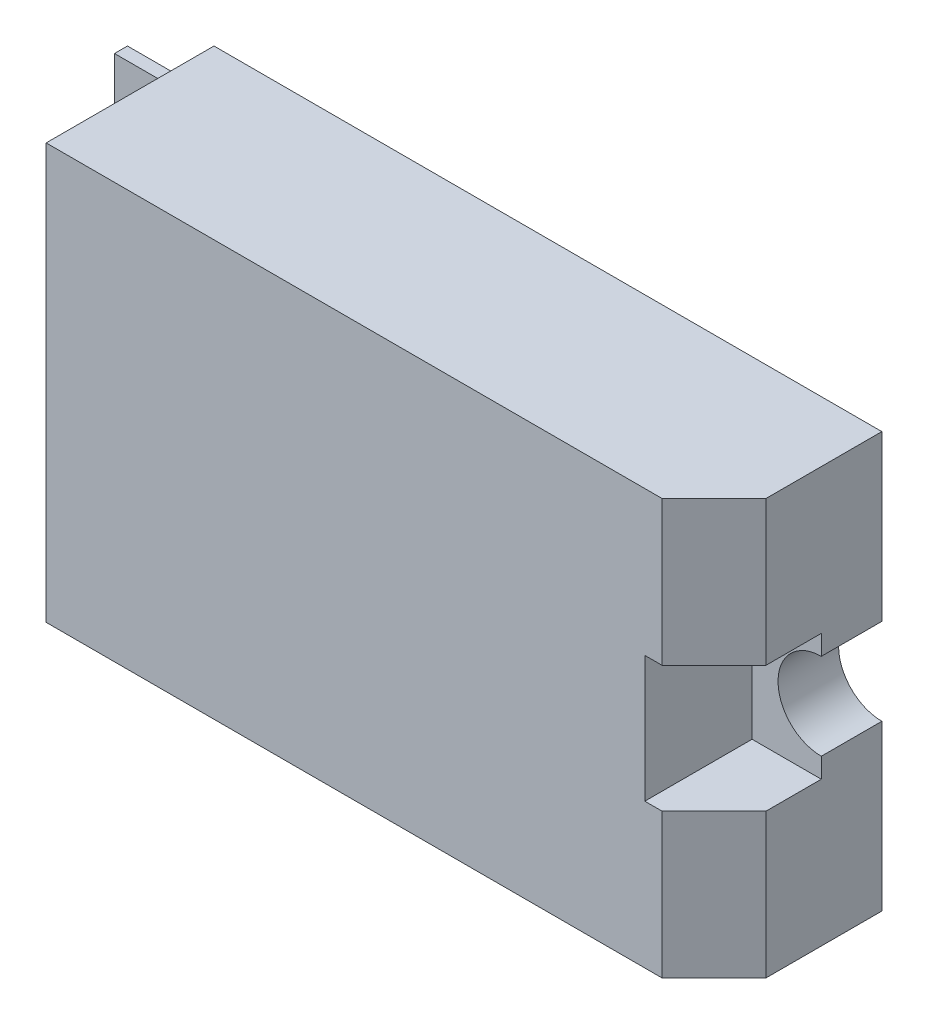
ISO-10303-21;
HEADER;
FILE_DESCRIPTION(('STEP AP214'),'2;1');
FILE_NAME('part.step','',(''),(''),'','','');
FILE_SCHEMA(('AUTOMOTIVE_DESIGN { 1 0 10303 214 1 1 1 1 }'));
ENDSEC;
DATA;
#1=APPLICATION_CONTEXT('core data for automotive mechanical design processes');
#2=APPLICATION_PROTOCOL_DEFINITION('international standard','automotive_design',2000,#1);
#3=PRODUCT_CONTEXT('',#1,'mechanical');
#4=PRODUCT('Part','Part','',(#3));
#5=PRODUCT_RELATED_PRODUCT_CATEGORY('part','',(#4));
#6=PRODUCT_DEFINITION_FORMATION('','',#4);
#7=PRODUCT_DEFINITION_CONTEXT('part definition',#1,'design');
#8=PRODUCT_DEFINITION('design','',#6,#7);
#9=PRODUCT_DEFINITION_SHAPE('','',#8);
#10=(LENGTH_UNIT() NAMED_UNIT(*) SI_UNIT(.MILLI.,.METRE.));
#11=(NAMED_UNIT(*) PLANE_ANGLE_UNIT() SI_UNIT($,.RADIAN.));
#12=(NAMED_UNIT(*) SI_UNIT($,.STERADIAN.) SOLID_ANGLE_UNIT());
#13=UNCERTAINTY_MEASURE_WITH_UNIT(LENGTH_MEASURE(1.E-05),#10,'distance_accuracy_value','');
#14=(GEOMETRIC_REPRESENTATION_CONTEXT(3) GLOBAL_UNCERTAINTY_ASSIGNED_CONTEXT((#13)) GLOBAL_UNIT_ASSIGNED_CONTEXT((#10,
#11,#12)) REPRESENTATION_CONTEXT('',''));
#15=CARTESIAN_POINT('',(0.,0.,0.));
#16=DIRECTION('',(0.,0.,1.));
#17=DIRECTION('',(1.,0.,0.));
#18=AXIS2_PLACEMENT_3D('',#15,#16,#17);
#19=CARTESIAN_POINT('',(1.50135924250436,-45.8595427549521,-34.4125020386911));
#20=DIRECTION('',(-1.,0.,0.));
#21=DIRECTION('',(0.,-1.,0.));
#22=AXIS2_PLACEMENT_3D('',#19,#20,#21);
#23=PLANE('',#22);
#24=DIRECTION('',(0.,1.,0.));
#25=VECTOR('',#24,1.);
#26=CARTESIAN_POINT('',(1.50135924250436,-45.8595427549521,-44.1125020386911));
#27=LINE('',#26,#25);
#28=CARTESIAN_POINT('',(1.50135924250436,-69.8595427549521,-44.1125020386911));
#29=VERTEX_POINT('',#28);
#30=CARTESIAN_POINT('',(1.50135924250436,-60.3595427549521,-44.1125020386911));
#31=VERTEX_POINT('',#30);
#32=EDGE_CURVE('E176',#29,#31,#27,.T.);
#33=ORIENTED_EDGE('',*,*,#32,.T.);
#34=DIRECTION('',(0.,0.,1.));
#35=VECTOR('',#34,1.);
#36=CARTESIAN_POINT('',(1.50135924250436,-60.3595427549521,-44.1125020386911));
#37=LINE('',#36,#35);
#38=CARTESIAN_POINT('',(1.50135924250436,-60.3595427549521,-40.6125020386911));
#39=VERTEX_POINT('',#38);
#40=EDGE_CURVE('E157',#31,#39,#37,.T.);
#41=ORIENTED_EDGE('',*,*,#40,.T.);
#42=DIRECTION('',(0.,1.,0.));
#43=VECTOR('',#42,1.);
#44=CARTESIAN_POINT('',(1.50135924250436,-54.2095427549521,-40.6125020386911));
#45=LINE('',#44,#43);
#46=CARTESIAN_POINT('',(1.50135924250436,-61.5095427549521,-40.6125020386911));
#47=VERTEX_POINT('',#46);
#48=EDGE_CURVE('E263',#47,#39,#45,.T.);
#49=ORIENTED_EDGE('',*,*,#48,.F.);
#50=DIRECTION('',(0.,0.,1.));
#51=VECTOR('',#50,1.);
#52=CARTESIAN_POINT('',(1.50135924250436,-61.5095427549521,-40.6125020386911));
#53=LINE('',#52,#51);
#54=CARTESIAN_POINT('',(1.50135924250435,-61.5095427549521,-37.4125020386911));
#55=VERTEX_POINT('',#54);
#56=EDGE_CURVE('E267',#47,#55,#53,.T.);
#57=ORIENTED_EDGE('',*,*,#56,.T.);
#58=DIRECTION('',(0.,-1.,0.));
#59=VECTOR('',#58,1.);
#60=CARTESIAN_POINT('',(1.50135924250436,-69.8595427549521,-37.4125020386911));
#61=LINE('',#60,#59);
#62=CARTESIAN_POINT('',(1.50135924250436,-69.8595427549521,-37.4125020386911));
#63=VERTEX_POINT('',#62);
#64=EDGE_CURVE('E203',#55,#63,#61,.T.);
#65=ORIENTED_EDGE('',*,*,#64,.T.);
#66=DIRECTION('',(0.,0.,-1.));
#67=VECTOR('',#66,1.);
#68=CARTESIAN_POINT('',(1.50135924250436,-69.8595427549521,-34.4125020386911));
#69=LINE('',#68,#67);
#70=EDGE_CURVE('E192',#63,#29,#69,.T.);
#71=ORIENTED_EDGE('',*,*,#70,.T.);
#72=EDGE_LOOP('',(#33,#41,#49,#57,#65,#71));
#73=FACE_BOUND('',#72,.T.);
#74=ADVANCED_FACE('F42',(#73),#23,.F.);
#75=CARTESIAN_POINT('',(-1.49864075749565,0.,-34.4125020386911));
#76=DIRECTION('',(0.707106781186549,0.,0.707106781186546));
#77=DIRECTION('',(0.,-1.,0.));
#78=AXIS2_PLACEMENT_3D('',#75,#76,#77);
#79=PLANE('',#78);
#80=DIRECTION('',(0.707106781186546,0.,-0.707106781186549));
#81=VECTOR('',#80,1.);
#82=CARTESIAN_POINT('',(-1.49864075749559,-61.5095427549521,-34.4125020386911));
#83=LINE('',#82,#81);
#84=CARTESIAN_POINT('',(-1.49864075749563,-61.5095427549521,-34.4125020386911));
#85=VERTEX_POINT('',#84);
#86=EDGE_CURVE('E11',#85,#55,#83,.T.);
#87=ORIENTED_EDGE('',*,*,#86,.F.);
#88=DIRECTION('',(0.,1.,0.));
#89=VECTOR('',#88,1.);
#90=CARTESIAN_POINT('',(-1.49864075749564,-45.8595427549521,-34.4125020386911));
#91=LINE('',#90,#89);
#92=CARTESIAN_POINT('',(-1.49864075749563,-69.8595427549521,-34.4125020386911));
#93=VERTEX_POINT('',#92);
#94=EDGE_CURVE('E198',#93,#85,#91,.T.);
#95=ORIENTED_EDGE('',*,*,#94,.F.);
#96=DIRECTION('',(-0.707106781186546,0.,0.707106781186549));
#97=VECTOR('',#96,1.);
#98=CARTESIAN_POINT('',(-1.49864075749564,-69.8595427549521,-34.412502038691));
#99=LINE('',#98,#97);
#100=EDGE_CURVE('E207',#63,#93,#99,.T.);
#101=ORIENTED_EDGE('',*,*,#100,.F.);
#102=ORIENTED_EDGE('',*,*,#64,.F.);
#103=EDGE_LOOP('',(#87,#95,#101,#102));
#104=FACE_BOUND('',#103,.T.);
#105=ADVANCED_FACE('F259',(#104),#79,.T.);
#106=CARTESIAN_POINT('',(-37.0986407574956,-45.8595427549521,-34.4125020386911));
#107=DIRECTION('',(1.,0.,0.));
#108=DIRECTION('',(0.,0.,-1.));
#109=AXIS2_PLACEMENT_3D('',#106,#107,#108);
#110=PLANE('',#109);
#111=DIRECTION('',(0.,-1.,0.));
#112=VECTOR('',#111,1.);
#113=CARTESIAN_POINT('',(-37.0986407574956,-45.8595427549521,-44.1125020386911));
#114=LINE('',#113,#112);
#115=CARTESIAN_POINT('',(-37.0986407574956,-45.8595427549521,-44.1125020386911));
#116=VERTEX_POINT('',#115);
#117=CARTESIAN_POINT('',(-37.0986407574956,-69.8595427549521,-44.1125020386911));
#118=VERTEX_POINT('',#117);
#119=EDGE_CURVE('E180',#116,#118,#114,.T.);
#120=ORIENTED_EDGE('',*,*,#119,.T.);
#121=DIRECTION('',(0.,0.,-1.));
#122=VECTOR('',#121,1.);
#123=CARTESIAN_POINT('',(-37.0986407574956,-69.8595427549521,-34.4125020386911));
#124=LINE('',#123,#122);
#125=CARTESIAN_POINT('',(-37.0986407574956,-69.8595427549521,-34.4125020386911));
#126=VERTEX_POINT('',#125);
#127=EDGE_CURVE('E194',#126,#118,#124,.T.);
#128=ORIENTED_EDGE('',*,*,#127,.F.);
#129=DIRECTION('',(0.,-1.,0.));
#130=VECTOR('',#129,1.);
#131=CARTESIAN_POINT('',(-37.0986407574956,-45.8595427549521,-34.4125020386911));
#132=LINE('',#131,#130);
#133=CARTESIAN_POINT('',(-37.0986407574956,-45.8595427549521,-34.4125020386911));
#134=VERTEX_POINT('',#133);
#135=EDGE_CURVE('E185',#134,#126,#132,.T.);
#136=ORIENTED_EDGE('',*,*,#135,.F.);
#137=DIRECTION('',(0.,0.,-1.));
#138=VECTOR('',#137,1.);
#139=CARTESIAN_POINT('',(-37.0986407574956,-45.8595427549521,-34.4125020386911));
#140=LINE('',#139,#138);
#141=EDGE_CURVE('E186',#134,#116,#140,.T.);
#142=ORIENTED_EDGE('',*,*,#141,.T.);
#143=EDGE_LOOP('',(#120,#128,#136,#142));
#144=FACE_BOUND('',#143,.T.);
#145=DIRECTION('',(0.,-1.,0.));
#146=VECTOR('',#145,1.);
#147=CARTESIAN_POINT('',(-37.0986407574956,-47.3595427549521,-43.1125020386911));
#148=LINE('',#147,#146);
#149=CARTESIAN_POINT('',(-37.0986407574956,-47.3595427549521,-43.1125020386911));
#150=VERTEX_POINT('',#149);
#151=CARTESIAN_POINT('',(-37.0986407574956,-68.3595427549521,-43.112502038691));
#152=VERTEX_POINT('',#151);
#153=EDGE_CURVE('E270',#150,#152,#148,.T.);
#154=ORIENTED_EDGE('',*,*,#153,.F.);
#155=DIRECTION('',(0.,0.,-1.));
#156=VECTOR('',#155,1.);
#157=CARTESIAN_POINT('',(-37.0986407574956,-47.3595427549521,-43.1125020386911));
#158=LINE('',#157,#156);
#159=CARTESIAN_POINT('',(-37.0986407574956,-47.3595427549521,-42.362502038691));
#160=VERTEX_POINT('',#159);
#161=EDGE_CURVE('E281',#160,#150,#158,.T.);
#162=ORIENTED_EDGE('',*,*,#161,.F.);
#163=DIRECTION('',(0.,1.,0.));
#164=VECTOR('',#163,1.);
#165=CARTESIAN_POINT('',(-37.0986407574956,-47.3595427549521,-42.362502038691));
#166=LINE('',#165,#164);
#167=CARTESIAN_POINT('',(-37.0986407574956,-68.3595427549521,-42.362502038691));
#168=VERTEX_POINT('',#167);
#169=EDGE_CURVE('E291',#168,#160,#166,.T.);
#170=ORIENTED_EDGE('',*,*,#169,.F.);
#171=DIRECTION('',(0.,0.,1.));
#172=VECTOR('',#171,1.);
#173=CARTESIAN_POINT('',(-37.0986407574956,-68.3595427549521,-43.112502038691));
#174=LINE('',#173,#172);
#175=EDGE_CURVE('E289',#152,#168,#174,.T.);
#176=ORIENTED_EDGE('',*,*,#175,.F.);
#177=EDGE_LOOP('',(#154,#162,#170,#176));
#178=FACE_BOUND('',#177,.T.);
#179=ADVANCED_FACE('F250',(#144,#178),#110,.F.);
#180=CARTESIAN_POINT('',(-37.0986407574956,-69.8595427549521,-34.4125020386911));
#181=DIRECTION('',(0.,1.,0.));
#182=DIRECTION('',(0.,0.,1.));
#183=AXIS2_PLACEMENT_3D('',#180,#181,#182);
#184=PLANE('',#183);
#185=ORIENTED_EDGE('',*,*,#70,.F.);
#186=ORIENTED_EDGE('',*,*,#100,.T.);
#187=DIRECTION('',(1.,0.,0.));
#188=VECTOR('',#187,1.);
#189=CARTESIAN_POINT('',(-37.0986407574956,-69.8595427549521,-34.4125020386911));
#190=LINE('',#189,#188);
#191=EDGE_CURVE('E229',#126,#93,#190,.T.);
#192=ORIENTED_EDGE('',*,*,#191,.F.);
#193=ORIENTED_EDGE('',*,*,#127,.T.);
#194=DIRECTION('',(1.,0.,0.));
#195=VECTOR('',#194,1.);
#196=CARTESIAN_POINT('',(-37.0986407574956,-69.8595427549521,-44.1125020386911));
#197=LINE('',#196,#195);
#198=EDGE_CURVE('E177',#118,#29,#197,.T.);
#199=ORIENTED_EDGE('',*,*,#198,.T.);
#200=EDGE_LOOP('',(#185,#186,#192,#193,#199));
#201=FACE_BOUND('',#200,.T.);
#202=ADVANCED_FACE('F254',(#201),#184,.F.);
#203=CARTESIAN_POINT('',(1.50135924250436,-55.3595427549521,-40.6125020386911));
#204=VERTEX_POINT('',#203);
#205=CARTESIAN_POINT('',(1.50135924250436,-54.2095427549521,-40.6125020386911));
#206=VERTEX_POINT('',#205);
#207=EDGE_CURVE('E170',#204,#206,#45,.T.);
#208=ORIENTED_EDGE('',*,*,#207,.F.);
#209=DIRECTION('',(0.,0.,1.));
#210=VECTOR('',#209,1.);
#211=CARTESIAN_POINT('',(1.50135924250436,-55.3595427549521,-44.1125020386911));
#212=LINE('',#211,#210);
#213=CARTESIAN_POINT('',(1.50135924250436,-55.3595427549521,-44.1125020386911));
#214=VERTEX_POINT('',#213);
#215=EDGE_CURVE('E58',#204,#214,#212,.F.);
#216=ORIENTED_EDGE('',*,*,#215,.T.);
#217=CARTESIAN_POINT('',(1.50135924250436,-45.8595427549521,-44.1125020386911));
#218=VERTEX_POINT('',#217);
#219=EDGE_CURVE('E168',#214,#218,#27,.T.);
#220=ORIENTED_EDGE('',*,*,#219,.T.);
#221=DIRECTION('',(0.,0.,-1.));
#222=VECTOR('',#221,1.);
#223=CARTESIAN_POINT('',(1.50135924250436,-45.8595427549521,-34.4125020386911));
#224=LINE('',#223,#222);
#225=CARTESIAN_POINT('',(1.50135924250436,-45.8595427549521,-37.4125020386911));
#226=VERTEX_POINT('',#225);
#227=EDGE_CURVE('E189',#226,#218,#224,.T.);
#228=ORIENTED_EDGE('',*,*,#227,.F.);
#229=CARTESIAN_POINT('',(1.50135924250436,-54.2095427549521,-37.4125020386911));
#230=VERTEX_POINT('',#229);
#231=EDGE_CURVE('E204',#226,#230,#61,.T.);
#232=ORIENTED_EDGE('',*,*,#231,.T.);
#233=DIRECTION('',(0.,0.,1.));
#234=VECTOR('',#233,1.);
#235=CARTESIAN_POINT('',(1.50135924250436,-54.2095427549521,-40.6125020386911));
#236=LINE('',#235,#234);
#237=EDGE_CURVE('E66',#206,#230,#236,.T.);
#238=ORIENTED_EDGE('',*,*,#237,.F.);
#239=EDGE_LOOP('',(#208,#216,#220,#228,#232,#238));
#240=FACE_BOUND('',#239,.T.);
#241=ADVANCED_FACE('F166',(#240),#23,.F.);
#242=CARTESIAN_POINT('',(-37.0986407574956,-45.8595427549521,-34.4125020386911));
#243=DIRECTION('',(0.,-1.,0.));
#244=DIRECTION('',(0.,0.,-1.));
#245=AXIS2_PLACEMENT_3D('',#242,#243,#244);
#246=PLANE('',#245);
#247=DIRECTION('',(-1.,0.,0.));
#248=VECTOR('',#247,1.);
#249=CARTESIAN_POINT('',(-37.0986407574956,-45.8595427549521,-34.4125020386911));
#250=LINE('',#249,#248);
#251=CARTESIAN_POINT('',(-1.49864075749564,-45.8595427549521,-34.4125020386911));
#252=VERTEX_POINT('',#251);
#253=EDGE_CURVE('E190',#252,#134,#250,.T.);
#254=ORIENTED_EDGE('',*,*,#253,.F.);
#255=DIRECTION('',(0.707106781186546,0.,-0.707106781186549));
#256=VECTOR('',#255,1.);
#257=CARTESIAN_POINT('',(-1.49864075749564,-45.8595427549521,-34.412502038691));
#258=LINE('',#257,#256);
#259=EDGE_CURVE('E201',#252,#226,#258,.T.);
#260=ORIENTED_EDGE('',*,*,#259,.T.);
#261=ORIENTED_EDGE('',*,*,#227,.T.);
#262=DIRECTION('',(-1.,0.,0.));
#263=VECTOR('',#262,1.);
#264=CARTESIAN_POINT('',(-37.0986407574956,-45.8595427549521,-44.1125020386911));
#265=LINE('',#264,#263);
#266=EDGE_CURVE('E175',#218,#116,#265,.T.);
#267=ORIENTED_EDGE('',*,*,#266,.T.);
#268=ORIENTED_EDGE('',*,*,#141,.F.);
#269=EDGE_LOOP('',(#254,#260,#261,#267,#268));
#270=FACE_BOUND('',#269,.T.);
#271=ADVANCED_FACE('F226',(#270),#246,.F.);
#272=CARTESIAN_POINT('',(0.,0.,-34.4125020386911));
#273=DIRECTION('',(0.,0.,1.));
#274=DIRECTION('',(1.,0.,0.));
#275=AXIS2_PLACEMENT_3D('',#272,#273,#274);
#276=PLANE('',#275);
#277=DIRECTION('',(1.,0.,0.));
#278=VECTOR('',#277,1.);
#279=CARTESIAN_POINT('',(1.50135924250436,-61.5095427549521,-34.4125020386911));
#280=LINE('',#279,#278);
#281=CARTESIAN_POINT('',(-2.49864075749564,-61.5095427549521,-34.4125020386911));
#282=VERTEX_POINT('',#281);
#283=EDGE_CURVE('E260',#282,#85,#280,.T.);
#284=ORIENTED_EDGE('',*,*,#283,.F.);
#285=DIRECTION('',(0.,-1.,0.));
#286=VECTOR('',#285,1.);
#287=CARTESIAN_POINT('',(-2.49864075749564,-54.2095427549521,-34.4125020386911));
#288=LINE('',#287,#286);
#289=CARTESIAN_POINT('',(-2.49864075749564,-54.2095427549521,-34.4125020386911));
#290=VERTEX_POINT('',#289);
#291=EDGE_CURVE('E221',#290,#282,#288,.T.);
#292=ORIENTED_EDGE('',*,*,#291,.F.);
#293=DIRECTION('',(-1.,0.,0.));
#294=VECTOR('',#293,1.);
#295=CARTESIAN_POINT('',(1.50135924250436,-54.2095427549521,-34.4125020386911));
#296=LINE('',#295,#294);
#297=CARTESIAN_POINT('',(-1.49864075749563,-54.2095427549521,-34.4125020386911));
#298=VERTEX_POINT('',#297);
#299=EDGE_CURVE('E210',#298,#290,#296,.T.);
#300=ORIENTED_EDGE('',*,*,#299,.F.);
#301=EDGE_CURVE('E197',#298,#252,#91,.T.);
#302=ORIENTED_EDGE('',*,*,#301,.T.);
#303=ORIENTED_EDGE('',*,*,#253,.T.);
#304=ORIENTED_EDGE('',*,*,#135,.T.);
#305=ORIENTED_EDGE('',*,*,#191,.T.);
#306=ORIENTED_EDGE('',*,*,#94,.T.);
#307=EDGE_LOOP('',(#284,#292,#300,#302,#303,#304,#305,#306));
#308=FACE_BOUND('',#307,.T.);
#309=ADVANCED_FACE('F218',(#308),#276,.T.);
#310=CARTESIAN_POINT('',(0.,0.,-44.1125020386911));
#311=DIRECTION('',(0.,0.,1.));
#312=DIRECTION('',(1.,0.,0.));
#313=AXIS2_PLACEMENT_3D('',#310,#311,#312);
#314=PLANE('',#313);
#315=ORIENTED_EDGE('',*,*,#219,.F.);
#316=CARTESIAN_POINT('',(1.50135924250436,-57.8595427549521,-44.1125020386911));
#317=DIRECTION('',(0.,0.,1.));
#318=DIRECTION('',(1.,0.,0.));
#319=AXIS2_PLACEMENT_3D('',#316,#317,#318);
#320=CIRCLE('',#319,2.5);
#321=EDGE_CURVE('E154',#214,#31,#320,.T.);
#322=ORIENTED_EDGE('',*,*,#321,.T.);
#323=ORIENTED_EDGE('',*,*,#32,.F.);
#324=ORIENTED_EDGE('',*,*,#198,.F.);
#325=ORIENTED_EDGE('',*,*,#119,.F.);
#326=ORIENTED_EDGE('',*,*,#266,.F.);
#327=EDGE_LOOP('',(#315,#322,#323,#324,#325,#326));
#328=FACE_BOUND('',#327,.T.);
#329=ADVANCED_FACE('F173',(#328),#314,.F.);
#330=CARTESIAN_POINT('',(-41.0986407574956,-47.3595427549521,-43.1125020386911));
#331=DIRECTION('',(0.,0.,1.));
#332=DIRECTION('',(0.,-1.,0.));
#333=AXIS2_PLACEMENT_3D('',#330,#331,#332);
#334=PLANE('',#333);
#335=ORIENTED_EDGE('',*,*,#153,.T.);
#336=DIRECTION('',(1.,0.,0.));
#337=VECTOR('',#336,1.);
#338=CARTESIAN_POINT('',(-41.0986407574956,-68.3595427549521,-43.112502038691));
#339=LINE('',#338,#337);
#340=CARTESIAN_POINT('',(-41.0986407574956,-68.3595427549521,-43.112502038691));
#341=VERTEX_POINT('',#340);
#342=EDGE_CURVE('E235',#341,#152,#339,.T.);
#343=ORIENTED_EDGE('',*,*,#342,.F.);
#344=DIRECTION('',(0.,-1.,0.));
#345=VECTOR('',#344,1.);
#346=CARTESIAN_POINT('',(-41.0986407574956,-47.3595427549521,-43.1125020386911));
#347=LINE('',#346,#345);
#348=CARTESIAN_POINT('',(-41.0986407574956,-47.3595427549521,-43.1125020386911));
#349=VERTEX_POINT('',#348);
#350=EDGE_CURVE('E277',#349,#341,#347,.T.);
#351=ORIENTED_EDGE('',*,*,#350,.F.);
#352=DIRECTION('',(1.,0.,0.));
#353=VECTOR('',#352,1.);
#354=CARTESIAN_POINT('',(-41.0986407574956,-47.3595427549521,-43.1125020386911));
#355=LINE('',#354,#353);
#356=EDGE_CURVE('E287',#349,#150,#355,.T.);
#357=ORIENTED_EDGE('',*,*,#356,.T.);
#358=EDGE_LOOP('',(#335,#343,#351,#357));
#359=FACE_BOUND('',#358,.T.);
#360=ADVANCED_FACE('F312',(#359),#334,.F.);
#361=CARTESIAN_POINT('',(-41.0986407574956,-68.3595427549521,-43.112502038691));
#362=DIRECTION('',(0.,1.,0.));
#363=DIRECTION('',(0.,0.,1.));
#364=AXIS2_PLACEMENT_3D('',#361,#362,#363);
#365=PLANE('',#364);
#366=ORIENTED_EDGE('',*,*,#175,.T.);
#367=DIRECTION('',(1.,0.,0.));
#368=VECTOR('',#367,1.);
#369=CARTESIAN_POINT('',(-41.0986407574956,-68.3595427549521,-42.362502038691));
#370=LINE('',#369,#368);
#371=CARTESIAN_POINT('',(-41.0986407574956,-68.3595427549521,-42.362502038691));
#372=VERTEX_POINT('',#371);
#373=EDGE_CURVE('E239',#372,#168,#370,.T.);
#374=ORIENTED_EDGE('',*,*,#373,.F.);
#375=DIRECTION('',(0.,0.,1.));
#376=VECTOR('',#375,1.);
#377=CARTESIAN_POINT('',(-41.0986407574956,-68.3595427549521,-43.112502038691));
#378=LINE('',#377,#376);
#379=EDGE_CURVE('E280',#341,#372,#378,.T.);
#380=ORIENTED_EDGE('',*,*,#379,.F.);
#381=ORIENTED_EDGE('',*,*,#342,.T.);
#382=EDGE_LOOP('',(#366,#374,#380,#381));
#383=FACE_BOUND('',#382,.T.);
#384=ADVANCED_FACE('F307',(#383),#365,.F.);
#385=CARTESIAN_POINT('',(-41.0986407574956,-47.3595427549521,-42.362502038691));
#386=DIRECTION('',(0.,0.,-1.));
#387=DIRECTION('',(-1.,0.,0.));
#388=AXIS2_PLACEMENT_3D('',#385,#386,#387);
#389=PLANE('',#388);
#390=ORIENTED_EDGE('',*,*,#169,.T.);
#391=DIRECTION('',(1.,0.,0.));
#392=VECTOR('',#391,1.);
#393=CARTESIAN_POINT('',(-41.0986407574956,-47.3595427549521,-42.362502038691));
#394=LINE('',#393,#392);
#395=CARTESIAN_POINT('',(-41.0986407574956,-47.3595427549521,-42.362502038691));
#396=VERTEX_POINT('',#395);
#397=EDGE_CURVE('E246',#396,#160,#394,.T.);
#398=ORIENTED_EDGE('',*,*,#397,.F.);
#399=DIRECTION('',(0.,1.,0.));
#400=VECTOR('',#399,1.);
#401=CARTESIAN_POINT('',(-41.0986407574956,-47.3595427549521,-42.362502038691));
#402=LINE('',#401,#400);
#403=EDGE_CURVE('E283',#372,#396,#402,.T.);
#404=ORIENTED_EDGE('',*,*,#403,.F.);
#405=ORIENTED_EDGE('',*,*,#373,.T.);
#406=EDGE_LOOP('',(#390,#398,#404,#405));
#407=FACE_BOUND('',#406,.T.);
#408=ADVANCED_FACE('F305',(#407),#389,.F.);
#409=CARTESIAN_POINT('',(-41.0986407574956,-47.3595427549521,-43.1125020386911));
#410=DIRECTION('',(0.,-1.,0.));
#411=DIRECTION('',(0.,0.,-1.));
#412=AXIS2_PLACEMENT_3D('',#409,#410,#411);
#413=PLANE('',#412);
#414=ORIENTED_EDGE('',*,*,#161,.T.);
#415=ORIENTED_EDGE('',*,*,#356,.F.);
#416=DIRECTION('',(0.,0.,-1.));
#417=VECTOR('',#416,1.);
#418=CARTESIAN_POINT('',(-41.0986407574956,-47.3595427549521,-43.1125020386911));
#419=LINE('',#418,#417);
#420=EDGE_CURVE('E285',#396,#349,#419,.T.);
#421=ORIENTED_EDGE('',*,*,#420,.F.);
#422=ORIENTED_EDGE('',*,*,#397,.T.);
#423=EDGE_LOOP('',(#414,#415,#421,#422));
#424=FACE_BOUND('',#423,.T.);
#425=ADVANCED_FACE('F301',(#424),#413,.F.);
#426=CARTESIAN_POINT('',(-41.0986407574956,0.,0.));
#427=DIRECTION('',(-1.,0.,0.));
#428=DIRECTION('',(0.,0.,1.));
#429=AXIS2_PLACEMENT_3D('',#426,#427,#428);
#430=PLANE('',#429);
#431=ORIENTED_EDGE('',*,*,#350,.T.);
#432=ORIENTED_EDGE('',*,*,#379,.T.);
#433=ORIENTED_EDGE('',*,*,#403,.T.);
#434=ORIENTED_EDGE('',*,*,#420,.T.);
#435=EDGE_LOOP('',(#431,#432,#433,#434));
#436=FACE_BOUND('',#435,.T.);
#437=ADVANCED_FACE('F310',(#436),#430,.T.);
#438=DIRECTION('',(-0.707106781186546,0.,0.707106781186549));
#439=VECTOR('',#438,1.);
#440=CARTESIAN_POINT('',(-1.49864075749574,-54.2095427549521,-34.412502038691));
#441=LINE('',#440,#439);
#442=EDGE_CURVE('E51',#230,#298,#441,.T.);
#443=ORIENTED_EDGE('',*,*,#442,.F.);
#444=ORIENTED_EDGE('',*,*,#231,.F.);
#445=ORIENTED_EDGE('',*,*,#259,.F.);
#446=ORIENTED_EDGE('',*,*,#301,.F.);
#447=EDGE_LOOP('',(#443,#444,#445,#446));
#448=FACE_BOUND('',#447,.T.);
#449=ADVANCED_FACE('F45',(#448),#79,.T.);
#450=CARTESIAN_POINT('',(1.50135924250436,-61.5095427549521,-40.6125020386911));
#451=DIRECTION('',(0.,-1.,0.));
#452=DIRECTION('',(1.,0.,0.));
#453=AXIS2_PLACEMENT_3D('',#450,#451,#452);
#454=PLANE('',#453);
#455=ORIENTED_EDGE('',*,*,#86,.T.);
#456=ORIENTED_EDGE('',*,*,#56,.F.);
#457=DIRECTION('',(1.,0.,0.));
#458=VECTOR('',#457,1.);
#459=CARTESIAN_POINT('',(1.50135924250436,-61.5095427549521,-40.6125020386911));
#460=LINE('',#459,#458);
#461=CARTESIAN_POINT('',(-2.49864075749564,-61.5095427549521,-40.6125020386911));
#462=VERTEX_POINT('',#461);
#463=EDGE_CURVE('E276',#462,#47,#460,.T.);
#464=ORIENTED_EDGE('',*,*,#463,.F.);
#465=DIRECTION('',(0.,0.,1.));
#466=VECTOR('',#465,1.);
#467=CARTESIAN_POINT('',(-2.49864075749564,-61.5095427549521,-40.6125020386911));
#468=LINE('',#467,#466);
#469=EDGE_CURVE('E271',#462,#282,#468,.T.);
#470=ORIENTED_EDGE('',*,*,#469,.T.);
#471=ORIENTED_EDGE('',*,*,#283,.T.);
#472=EDGE_LOOP('',(#455,#456,#464,#470,#471));
#473=FACE_BOUND('',#472,.T.);
#474=ADVANCED_FACE('F367',(#473),#454,.F.);
#475=CARTESIAN_POINT('',(-2.49864075749564,-54.2095427549521,-40.6125020386911));
#476=DIRECTION('',(-1.,0.,0.));
#477=DIRECTION('',(0.,0.,1.));
#478=AXIS2_PLACEMENT_3D('',#475,#476,#477);
#479=PLANE('',#478);
#480=ORIENTED_EDGE('',*,*,#291,.T.);
#481=ORIENTED_EDGE('',*,*,#469,.F.);
#482=DIRECTION('',(0.,-1.,0.));
#483=VECTOR('',#482,1.);
#484=CARTESIAN_POINT('',(-2.49864075749564,-54.2095427549521,-40.6125020386911));
#485=LINE('',#484,#483);
#486=CARTESIAN_POINT('',(-2.49864075749564,-54.2095427549521,-40.6125020386911));
#487=VERTEX_POINT('',#486);
#488=EDGE_CURVE('E509',#487,#462,#485,.T.);
#489=ORIENTED_EDGE('',*,*,#488,.F.);
#490=DIRECTION('',(0.,0.,1.));
#491=VECTOR('',#490,1.);
#492=CARTESIAN_POINT('',(-2.49864075749564,-54.2095427549521,-40.6125020386911));
#493=LINE('',#492,#491);
#494=EDGE_CURVE('E273',#487,#290,#493,.T.);
#495=ORIENTED_EDGE('',*,*,#494,.T.);
#496=EDGE_LOOP('',(#480,#481,#489,#495));
#497=FACE_BOUND('',#496,.T.);
#498=ADVANCED_FACE('F377',(#497),#479,.F.);
#499=CARTESIAN_POINT('',(1.50135924250436,-54.2095427549521,-40.6125020386911));
#500=DIRECTION('',(0.,1.,0.));
#501=DIRECTION('',(-1.,0.,0.));
#502=AXIS2_PLACEMENT_3D('',#499,#500,#501);
#503=PLANE('',#502);
#504=ORIENTED_EDGE('',*,*,#442,.T.);
#505=ORIENTED_EDGE('',*,*,#299,.T.);
#506=ORIENTED_EDGE('',*,*,#494,.F.);
#507=DIRECTION('',(-1.,0.,0.));
#508=VECTOR('',#507,1.);
#509=CARTESIAN_POINT('',(1.50135924250436,-54.2095427549521,-40.6125020386911));
#510=LINE('',#509,#508);
#511=EDGE_CURVE('E507',#206,#487,#510,.T.);
#512=ORIENTED_EDGE('',*,*,#511,.F.);
#513=ORIENTED_EDGE('',*,*,#237,.T.);
#514=EDGE_LOOP('',(#504,#505,#506,#512,#513));
#515=FACE_BOUND('',#514,.T.);
#516=ADVANCED_FACE('F209',(#515),#503,.F.);
#517=CARTESIAN_POINT('',(0.,0.,-40.6125020386911));
#518=DIRECTION('',(0.,0.,-1.));
#519=DIRECTION('',(-1.,0.,0.));
#520=AXIS2_PLACEMENT_3D('',#517,#518,#519);
#521=PLANE('',#520);
#522=ORIENTED_EDGE('',*,*,#48,.T.);
#523=CARTESIAN_POINT('',(1.50135924250436,-57.8595427549521,-40.6125020386911));
#524=DIRECTION('',(0.,0.,1.));
#525=DIRECTION('',(1.,0.,0.));
#526=AXIS2_PLACEMENT_3D('',#523,#524,#525);
#527=CIRCLE('',#526,2.5);
#528=EDGE_CURVE('E162',#204,#39,#527,.T.);
#529=ORIENTED_EDGE('',*,*,#528,.F.);
#530=ORIENTED_EDGE('',*,*,#207,.T.);
#531=ORIENTED_EDGE('',*,*,#511,.T.);
#532=ORIENTED_EDGE('',*,*,#488,.T.);
#533=ORIENTED_EDGE('',*,*,#463,.T.);
#534=EDGE_LOOP('',(#522,#529,#530,#531,#532,#533));
#535=FACE_BOUND('',#534,.T.);
#536=ADVANCED_FACE('F395',(#535),#521,.F.);
#537=CARTESIAN_POINT('',(1.50135924250436,-57.8595427549521,-44.1125020386911));
#538=DIRECTION('',(0.,0.,1.));
#539=DIRECTION('',(1.,0.,0.));
#540=AXIS2_PLACEMENT_3D('',#537,#538,#539);
#541=CYLINDRICAL_SURFACE('',#540,2.5);
#542=ORIENTED_EDGE('',*,*,#321,.F.);
#543=ORIENTED_EDGE('',*,*,#215,.F.);
#544=ORIENTED_EDGE('',*,*,#528,.T.);
#545=ORIENTED_EDGE('',*,*,#40,.F.);
#546=EDGE_LOOP('',(#542,#543,#544,#545));
#547=FACE_BOUND('',#546,.T.);
#548=ADVANCED_FACE('F155',(#547),#541,.F.);
#549=CLOSED_SHELL('',(#74,#105,#179,#202,#241,#271,#309,#329,#360,#384,#408,#425,#437,#449,#474,
#498,#516,#536,#548));
#550=MANIFOLD_SOLID_BREP('B2',#549);
#551=ADVANCED_BREP_SHAPE_REPRESENTATION('',(#18,#550),#14);
#552=SHAPE_DEFINITION_REPRESENTATION(#9,#551);
ENDSEC;
END-ISO-10303-21;
